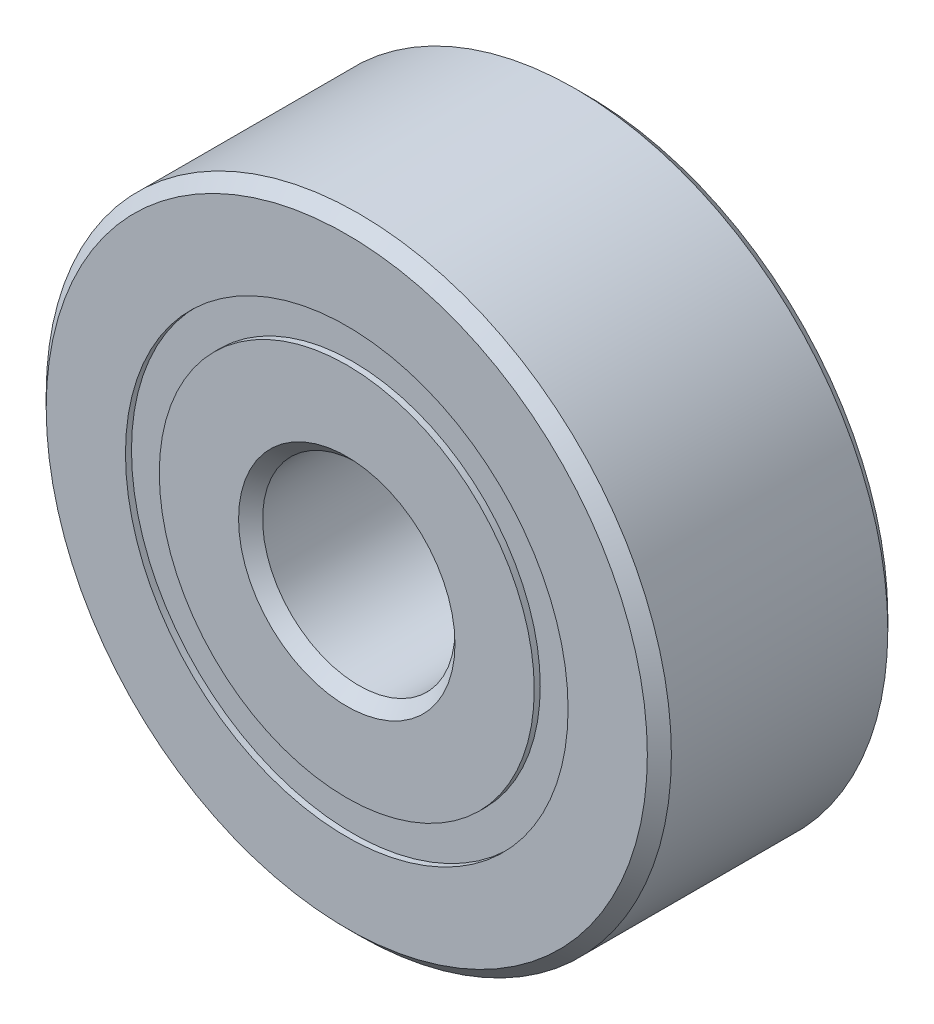
ISO-10303-21;
HEADER;
FILE_DESCRIPTION(('STEP AP214'),'2;1');
FILE_NAME('part.step','',(''),(''),'','','');
FILE_SCHEMA(('AUTOMOTIVE_DESIGN { 1 0 10303 214 1 1 1 1 }'));
ENDSEC;
DATA;
#1=APPLICATION_CONTEXT('core data for automotive mechanical design processes');
#2=APPLICATION_PROTOCOL_DEFINITION('international standard','automotive_design',2000,#1);
#3=PRODUCT_CONTEXT('',#1,'mechanical');
#4=PRODUCT('Part','Part','',(#3));
#5=PRODUCT_RELATED_PRODUCT_CATEGORY('part','',(#4));
#6=PRODUCT_DEFINITION_FORMATION('','',#4);
#7=PRODUCT_DEFINITION_CONTEXT('part definition',#1,'design');
#8=PRODUCT_DEFINITION('design','',#6,#7);
#9=PRODUCT_DEFINITION_SHAPE('','',#8);
#10=(LENGTH_UNIT() NAMED_UNIT(*) SI_UNIT(.MILLI.,.METRE.));
#11=(NAMED_UNIT(*) PLANE_ANGLE_UNIT() SI_UNIT($,.RADIAN.));
#12=(NAMED_UNIT(*) SI_UNIT($,.STERADIAN.) SOLID_ANGLE_UNIT());
#13=UNCERTAINTY_MEASURE_WITH_UNIT(LENGTH_MEASURE(1.E-05),#10,'distance_accuracy_value','');
#14=(GEOMETRIC_REPRESENTATION_CONTEXT(3) GLOBAL_UNCERTAINTY_ASSIGNED_CONTEXT((#13)) GLOBAL_UNIT_ASSIGNED_CONTEXT((#10,
#11,#12)) REPRESENTATION_CONTEXT('',''));
#15=CARTESIAN_POINT('',(0.,0.,0.));
#16=DIRECTION('',(0.,0.,1.));
#17=DIRECTION('',(1.,0.,0.));
#18=AXIS2_PLACEMENT_3D('',#15,#16,#17);
#19=CARTESIAN_POINT('',(0.,4.60164835164835,-2.375));
#20=DIRECTION('',(0.,0.,1.));
#21=DIRECTION('',(1.,0.,0.));
#22=AXIS2_PLACEMENT_3D('',#19,#20,#21);
#23=PLANE('',#22);
#24=CARTESIAN_POINT('',(0.,0.,-2.375));
#25=DIRECTION('',(0.,0.,1.));
#26=DIRECTION('',(1.,0.,0.));
#27=AXIS2_PLACEMENT_3D('',#24,#25,#26);
#28=CIRCLE('',#27,4.60164835164835);
#29=CARTESIAN_POINT('',(4.60164835164835,0.,-2.375));
#30=VERTEX_POINT('',#29);
#31=EDGE_CURVE('E57',#30,#30,#28,.T.);
#32=ORIENTED_EDGE('',*,*,#31,.F.);
#33=EDGE_LOOP('',(#32));
#34=FACE_BOUND('',#33,.T.);
#35=CARTESIAN_POINT('',(0.,0.,-2.375));
#36=DIRECTION('',(0.,0.,1.));
#37=DIRECTION('',(1.,0.,0.));
#38=AXIS2_PLACEMENT_3D('',#35,#36,#37);
#39=CIRCLE('',#38,3.89835164835165);
#40=CARTESIAN_POINT('',(3.89835164835165,0.,-2.375));
#41=VERTEX_POINT('',#40);
#42=EDGE_CURVE('E11',#41,#41,#39,.T.);
#43=ORIENTED_EDGE('',*,*,#42,.T.);
#44=EDGE_LOOP('',(#43));
#45=FACE_BOUND('',#44,.T.);
#46=ADVANCED_FACE('F43',(#34,#45),#23,.F.);
#47=CARTESIAN_POINT('',(0.,0.,2.5));
#48=DIRECTION('',(0.,0.,1.));
#49=DIRECTION('',(1.,0.,0.));
#50=AXIS2_PLACEMENT_3D('',#47,#48,#49);
#51=CYLINDRICAL_SURFACE('',#50,3.89835164835165);
#52=ORIENTED_EDGE('',*,*,#42,.F.);
#53=EDGE_LOOP('',(#52));
#54=FACE_BOUND('',#53,.T.);
#55=CARTESIAN_POINT('',(0.,0.,-1.16542887575844));
#56=DIRECTION('',(0.,0.,1.));
#57=DIRECTION('',(1.,0.,0.));
#58=AXIS2_PLACEMENT_3D('',#55,#56,#57);
#59=CIRCLE('',#58,3.89835164835165);
#60=CARTESIAN_POINT('',(3.89835164835165,0.,-1.16542887575844));
#61=VERTEX_POINT('',#60);
#62=EDGE_CURVE('E49',#61,#61,#59,.T.);
#63=ORIENTED_EDGE('',*,*,#62,.T.);
#64=EDGE_LOOP('',(#63));
#65=FACE_BOUND('',#64,.T.);
#66=ADVANCED_FACE('F66',(#54,#65),#51,.F.);
#67=CARTESIAN_POINT('',(0.,4.60164835164835,-1.16542887575844));
#68=DIRECTION('',(0.,0.,-1.));
#69=DIRECTION('',(-1.,0.,0.));
#70=AXIS2_PLACEMENT_3D('',#67,#68,#69);
#71=PLANE('',#70);
#72=ORIENTED_EDGE('',*,*,#62,.F.);
#73=EDGE_LOOP('',(#72));
#74=FACE_BOUND('',#73,.T.);
#75=CARTESIAN_POINT('',(0.,0.,-1.16542887575844));
#76=DIRECTION('',(0.,0.,1.));
#77=DIRECTION('',(1.,0.,0.));
#78=AXIS2_PLACEMENT_3D('',#75,#76,#77);
#79=CIRCLE('',#78,4.60164835164835);
#80=CARTESIAN_POINT('',(4.60164835164835,0.,-1.16542887575844));
#81=VERTEX_POINT('',#80);
#82=EDGE_CURVE('E53',#81,#81,#79,.T.);
#83=ORIENTED_EDGE('',*,*,#82,.T.);
#84=EDGE_LOOP('',(#83));
#85=FACE_BOUND('',#84,.T.);
#86=ADVANCED_FACE('F70',(#74,#85),#71,.F.);
#87=CARTESIAN_POINT('',(0.,0.,2.5));
#88=DIRECTION('',(0.,0.,1.));
#89=DIRECTION('',(1.,0.,0.));
#90=AXIS2_PLACEMENT_3D('',#87,#88,#89);
#91=CYLINDRICAL_SURFACE('',#90,4.60164835164835);
#92=ORIENTED_EDGE('',*,*,#82,.F.);
#93=EDGE_LOOP('',(#92));
#94=FACE_BOUND('',#93,.T.);
#95=ORIENTED_EDGE('',*,*,#31,.T.);
#96=EDGE_LOOP('',(#95));
#97=FACE_BOUND('',#96,.T.);
#98=ADVANCED_FACE('F63',(#94,#97),#91,.T.);
#99=CLOSED_SHELL('',(#46,#66,#86,#98));
#100=MANIFOLD_SOLID_BREP('B2',#99);
#101=CARTESIAN_POINT('',(0.,4.60164835164835,2.375));
#102=DIRECTION('',(0.,0.,-1.));
#103=DIRECTION('',(-1.,0.,0.));
#104=AXIS2_PLACEMENT_3D('',#101,#102,#103);
#105=PLANE('',#104);
#106=CARTESIAN_POINT('',(0.,0.,2.375));
#107=DIRECTION('',(0.,0.,1.));
#108=DIRECTION('',(1.,0.,0.));
#109=AXIS2_PLACEMENT_3D('',#106,#107,#108);
#110=CIRCLE('',#109,3.89835164835165);
#111=CARTESIAN_POINT('',(3.89835164835165,0.,2.375));
#112=VERTEX_POINT('',#111);
#113=EDGE_CURVE('E42',#112,#112,#110,.T.);
#114=ORIENTED_EDGE('',*,*,#113,.F.);
#115=EDGE_LOOP('',(#114));
#116=FACE_BOUND('',#115,.T.);
#117=CARTESIAN_POINT('',(0.,0.,2.375));
#118=DIRECTION('',(0.,0.,1.));
#119=DIRECTION('',(1.,0.,0.));
#120=AXIS2_PLACEMENT_3D('',#117,#118,#119);
#121=CIRCLE('',#120,4.60164835164835);
#122=CARTESIAN_POINT('',(4.60164835164835,0.,2.375));
#123=VERTEX_POINT('',#122);
#124=EDGE_CURVE('E124',#123,#123,#121,.T.);
#125=ORIENTED_EDGE('',*,*,#124,.T.);
#126=EDGE_LOOP('',(#125));
#127=FACE_BOUND('',#126,.T.);
#128=ADVANCED_FACE('F110',(#116,#127),#105,.F.);
#129=CARTESIAN_POINT('',(0.,0.,2.5));
#130=DIRECTION('',(0.,0.,1.));
#131=DIRECTION('',(1.,0.,0.));
#132=AXIS2_PLACEMENT_3D('',#129,#130,#131);
#133=CYLINDRICAL_SURFACE('',#132,3.89835164835165);
#134=CARTESIAN_POINT('',(0.,0.,1.16542887575844));
#135=DIRECTION('',(0.,0.,1.));
#136=DIRECTION('',(1.,0.,0.));
#137=AXIS2_PLACEMENT_3D('',#134,#135,#136);
#138=CIRCLE('',#137,3.89835164835165);
#139=CARTESIAN_POINT('',(3.89835164835165,0.,1.16542887575844));
#140=VERTEX_POINT('',#139);
#141=EDGE_CURVE('E116',#140,#140,#138,.T.);
#142=ORIENTED_EDGE('',*,*,#141,.F.);
#143=EDGE_LOOP('',(#142));
#144=FACE_BOUND('',#143,.T.);
#145=ORIENTED_EDGE('',*,*,#113,.T.);
#146=EDGE_LOOP('',(#145));
#147=FACE_BOUND('',#146,.T.);
#148=ADVANCED_FACE('F139',(#144,#147),#133,.F.);
#149=CARTESIAN_POINT('',(0.,4.60164835164835,1.16542887575844));
#150=DIRECTION('',(0.,0.,1.));
#151=DIRECTION('',(1.,0.,0.));
#152=AXIS2_PLACEMENT_3D('',#149,#150,#151);
#153=PLANE('',#152);
#154=CARTESIAN_POINT('',(0.,0.,1.16542887575844));
#155=DIRECTION('',(0.,0.,1.));
#156=DIRECTION('',(1.,0.,0.));
#157=AXIS2_PLACEMENT_3D('',#154,#155,#156);
#158=CIRCLE('',#157,4.60164835164835);
#159=CARTESIAN_POINT('',(4.60164835164835,0.,1.16542887575844));
#160=VERTEX_POINT('',#159);
#161=EDGE_CURVE('E120',#160,#160,#158,.T.);
#162=ORIENTED_EDGE('',*,*,#161,.F.);
#163=EDGE_LOOP('',(#162));
#164=FACE_BOUND('',#163,.T.);
#165=ORIENTED_EDGE('',*,*,#141,.T.);
#166=EDGE_LOOP('',(#165));
#167=FACE_BOUND('',#166,.T.);
#168=ADVANCED_FACE('F134',(#164,#167),#153,.F.);
#169=CARTESIAN_POINT('',(0.,0.,2.5));
#170=DIRECTION('',(0.,0.,1.));
#171=DIRECTION('',(1.,0.,0.));
#172=AXIS2_PLACEMENT_3D('',#169,#170,#171);
#173=CYLINDRICAL_SURFACE('',#172,4.60164835164835);
#174=ORIENTED_EDGE('',*,*,#124,.F.);
#175=EDGE_LOOP('',(#174));
#176=FACE_BOUND('',#175,.T.);
#177=ORIENTED_EDGE('',*,*,#161,.T.);
#178=EDGE_LOOP('',(#177));
#179=FACE_BOUND('',#178,.T.);
#180=ADVANCED_FACE('F131',(#176,#179),#173,.T.);
#181=CLOSED_SHELL('',(#128,#148,#168,#180));
#182=MANIFOLD_SOLID_BREP('B6',#181);
#183=CARTESIAN_POINT('',(-2.12499999999995,3.68060796608389,0.));
#184=DIRECTION('',(0.,0.,1.));
#185=DIRECTION('',(-0.499999999999989,0.866025403784445,0.));
#186=AXIS2_PLACEMENT_3D('',#183,#184,#185);
#187=SPHERICAL_SURFACE('',#186,1.16542887575844);
#188=CARTESIAN_POINT('',(-2.12499999999995,3.68060796608389,1.16542887575844));
#189=VERTEX_POINT('',#188);
#190=VERTEX_LOOP('',#189);
#191=FACE_BOUND('',#190,.T.);
#192=ADVANCED_FACE('F177',(#191),#187,.T.);
#193=CLOSED_SHELL('',(#192));
#194=MANIFOLD_SOLID_BREP('B37',#193);
#195=CARTESIAN_POINT('',(-3.68060796608384,2.12500000000004,0.));
#196=DIRECTION('',(0.,0.,1.));
#197=DIRECTION('',(-0.866025403784433,0.50000000000001,0.));
#198=AXIS2_PLACEMENT_3D('',#195,#196,#197);
#199=SPHERICAL_SURFACE('',#198,1.16542887575844);
#200=CARTESIAN_POINT('',(-3.68060796608384,2.12500000000004,1.16542887575844));
#201=VERTEX_POINT('',#200);
#202=VERTEX_LOOP('',#201);
#203=FACE_BOUND('',#202,.T.);
#204=ADVANCED_FACE('F197',(#203),#199,.T.);
#205=CLOSED_SHELL('',(#204));
#206=MANIFOLD_SOLID_BREP('B106',#205);
#207=CARTESIAN_POINT('',(-4.25,0.,0.));
#208=DIRECTION('',(0.,0.,1.));
#209=DIRECTION('',(-1.,0.,0.));
#210=AXIS2_PLACEMENT_3D('',#207,#208,#209);
#211=SPHERICAL_SURFACE('',#210,1.16542887575844);
#212=CARTESIAN_POINT('',(-4.25,0.,1.16542887575844));
#213=VERTEX_POINT('',#212);
#214=VERTEX_LOOP('',#213);
#215=FACE_BOUND('',#214,.T.);
#216=ADVANCED_FACE('F217',(#215),#211,.T.);
#217=CLOSED_SHELL('',(#216));
#218=MANIFOLD_SOLID_BREP('B173',#217);
#219=CARTESIAN_POINT('',(-3.68060796608388,-2.12499999999997,0.));
#220=DIRECTION('',(0.,0.,1.));
#221=DIRECTION('',(-0.866025403784443,-0.499999999999992,0.));
#222=AXIS2_PLACEMENT_3D('',#219,#220,#221);
#223=SPHERICAL_SURFACE('',#222,1.16542887575844);
#224=CARTESIAN_POINT('',(-3.68060796608388,-2.12499999999997,1.16542887575844));
#225=VERTEX_POINT('',#224);
#226=VERTEX_LOOP('',#225);
#227=FACE_BOUND('',#226,.T.);
#228=ADVANCED_FACE('F237',(#227),#223,.T.);
#229=CLOSED_SHELL('',(#228));
#230=MANIFOLD_SOLID_BREP('B193',#229);
#231=CARTESIAN_POINT('',(-2.12500000000003,-3.68060796608385,0.));
#232=DIRECTION('',(0.,0.,1.));
#233=DIRECTION('',(-0.500000000000007,-0.866025403784435,0.));
#234=AXIS2_PLACEMENT_3D('',#231,#232,#233);
#235=SPHERICAL_SURFACE('',#234,1.16542887575844);
#236=CARTESIAN_POINT('',(-2.12500000000003,-3.68060796608385,1.16542887575844));
#237=VERTEX_POINT('',#236);
#238=VERTEX_LOOP('',#237);
#239=FACE_BOUND('',#238,.T.);
#240=ADVANCED_FACE('F257',(#239),#235,.T.);
#241=CLOSED_SHELL('',(#240));
#242=MANIFOLD_SOLID_BREP('B213',#241);
#243=CARTESIAN_POINT('',(0.,-4.25,0.));
#244=DIRECTION('',(0.,0.,1.));
#245=DIRECTION('',(0.,-1.,0.));
#246=AXIS2_PLACEMENT_3D('',#243,#244,#245);
#247=SPHERICAL_SURFACE('',#246,1.16542887575844);
#248=CARTESIAN_POINT('',(0.,-4.25,1.16542887575844));
#249=VERTEX_POINT('',#248);
#250=VERTEX_LOOP('',#249);
#251=FACE_BOUND('',#250,.T.);
#252=ADVANCED_FACE('F277',(#251),#247,.T.);
#253=CLOSED_SHELL('',(#252));
#254=MANIFOLD_SOLID_BREP('B233',#253);
#255=CARTESIAN_POINT('',(2.12499999999998,-3.68060796608388,0.));
#256=DIRECTION('',(0.,0.,1.));
#257=DIRECTION('',(0.499999999999995,-0.866025403784442,0.));
#258=AXIS2_PLACEMENT_3D('',#255,#256,#257);
#259=SPHERICAL_SURFACE('',#258,1.16542887575844);
#260=CARTESIAN_POINT('',(2.12499999999998,-3.68060796608388,1.16542887575844));
#261=VERTEX_POINT('',#260);
#262=VERTEX_LOOP('',#261);
#263=FACE_BOUND('',#262,.T.);
#264=ADVANCED_FACE('F297',(#263),#259,.T.);
#265=CLOSED_SHELL('',(#264));
#266=MANIFOLD_SOLID_BREP('B253',#265);
#267=CARTESIAN_POINT('',(3.68060796608386,-2.12500000000002,0.));
#268=DIRECTION('',(0.,0.,1.));
#269=DIRECTION('',(0.866025403784436,-0.500000000000004,0.));
#270=AXIS2_PLACEMENT_3D('',#267,#268,#269);
#271=SPHERICAL_SURFACE('',#270,1.16542887575844);
#272=CARTESIAN_POINT('',(3.68060796608386,-2.12500000000002,1.16542887575844));
#273=VERTEX_POINT('',#272);
#274=VERTEX_LOOP('',#273);
#275=FACE_BOUND('',#274,.T.);
#276=ADVANCED_FACE('F317',(#275),#271,.T.);
#277=CLOSED_SHELL('',(#276));
#278=MANIFOLD_SOLID_BREP('B273',#277);
#279=CARTESIAN_POINT('',(4.25,0.,0.));
#280=DIRECTION('',(0.,0.,1.));
#281=DIRECTION('',(1.,0.,0.));
#282=AXIS2_PLACEMENT_3D('',#279,#280,#281);
#283=SPHERICAL_SURFACE('',#282,1.16542887575844);
#284=CARTESIAN_POINT('',(4.25,0.,1.16542887575844));
#285=VERTEX_POINT('',#284);
#286=VERTEX_LOOP('',#285);
#287=FACE_BOUND('',#286,.T.);
#288=ADVANCED_FACE('F337',(#287),#283,.T.);
#289=CLOSED_SHELL('',(#288));
#290=MANIFOLD_SOLID_BREP('B293',#289);
#291=CARTESIAN_POINT('',(3.68060796608387,2.12499999999999,0.));
#292=DIRECTION('',(0.,0.,1.));
#293=DIRECTION('',(0.86602540378444,0.499999999999998,0.));
#294=AXIS2_PLACEMENT_3D('',#291,#292,#293);
#295=SPHERICAL_SURFACE('',#294,1.16542887575844);
#296=CARTESIAN_POINT('',(3.68060796608387,2.12499999999999,1.16542887575844));
#297=VERTEX_POINT('',#296);
#298=VERTEX_LOOP('',#297);
#299=FACE_BOUND('',#298,.T.);
#300=ADVANCED_FACE('F357',(#299),#295,.T.);
#301=CLOSED_SHELL('',(#300));
#302=MANIFOLD_SOLID_BREP('B313',#301);
#303=CARTESIAN_POINT('',(2.125,3.68060796608386,0.));
#304=DIRECTION('',(0.,0.,1.));
#305=DIRECTION('',(0.500000000000001,0.866025403784438,0.));
#306=AXIS2_PLACEMENT_3D('',#303,#304,#305);
#307=SPHERICAL_SURFACE('',#306,1.16542887575844);
#308=CARTESIAN_POINT('',(2.125,3.68060796608386,1.16542887575844));
#309=VERTEX_POINT('',#308);
#310=VERTEX_LOOP('',#309);
#311=FACE_BOUND('',#310,.T.);
#312=ADVANCED_FACE('F377',(#311),#307,.T.);
#313=CLOSED_SHELL('',(#312));
#314=MANIFOLD_SOLID_BREP('B333',#313);
#315=CARTESIAN_POINT('',(0.,4.25,0.));
#316=DIRECTION('',(0.,0.,1.));
#317=DIRECTION('',(0.,1.,0.));
#318=AXIS2_PLACEMENT_3D('',#315,#316,#317);
#319=SPHERICAL_SURFACE('',#318,1.16542887575844);
#320=CARTESIAN_POINT('',(0.,4.25,1.16542887575844));
#321=VERTEX_POINT('',#320);
#322=VERTEX_LOOP('',#321);
#323=FACE_BOUND('',#322,.T.);
#324=ADVANCED_FACE('F399',(#323),#319,.T.);
#325=CLOSED_SHELL('',(#324));
#326=MANIFOLD_SOLID_BREP('B353',#325);
#327=CARTESIAN_POINT('',(0.,3.89835164835165,2.5));
#328=DIRECTION('',(0.,0.,-1.));
#329=DIRECTION('',(-1.,0.,0.));
#330=AXIS2_PLACEMENT_3D('',#327,#328,#329);
#331=PLANE('',#330);
#332=CARTESIAN_POINT('',(0.,0.,2.5));
#333=DIRECTION('',(0.,0.,1.));
#334=DIRECTION('',(1.,0.,0.));
#335=AXIS2_PLACEMENT_3D('',#332,#333,#334);
#336=CIRCLE('',#335,2.25);
#337=CARTESIAN_POINT('',(2.25,0.,2.5));
#338=VERTEX_POINT('',#337);
#339=EDGE_CURVE('E446',#338,#338,#336,.T.);
#340=ORIENTED_EDGE('',*,*,#339,.F.);
#341=EDGE_LOOP('',(#340));
#342=FACE_BOUND('',#341,.T.);
#343=CARTESIAN_POINT('',(0.,0.,2.5));
#344=DIRECTION('',(0.,0.,1.));
#345=DIRECTION('',(1.,0.,0.));
#346=AXIS2_PLACEMENT_3D('',#343,#344,#345);
#347=CIRCLE('',#346,3.89835164835165);
#348=CARTESIAN_POINT('',(3.89835164835165,0.,2.5));
#349=VERTEX_POINT('',#348);
#350=EDGE_CURVE('E398',#349,#349,#347,.T.);
#351=ORIENTED_EDGE('',*,*,#350,.T.);
#352=EDGE_LOOP('',(#351));
#353=FACE_BOUND('',#352,.T.);
#354=ADVANCED_FACE('F418',(#342,#353),#331,.F.);
#355=CARTESIAN_POINT('',(0.,0.,2.5));
#356=DIRECTION('',(0.,0.,1.));
#357=DIRECTION('',(1.,0.,0.));
#358=AXIS2_PLACEMENT_3D('',#355,#356,#357);
#359=CYLINDRICAL_SURFACE('',#358,3.89835164835165);
#360=ORIENTED_EDGE('',*,*,#350,.F.);
#361=EDGE_LOOP('',(#360));
#362=FACE_BOUND('',#361,.T.);
#363=CARTESIAN_POINT('',(0.,0.,1.11111111111111));
#364=DIRECTION('',(0.,0.,1.));
#365=DIRECTION('',(1.,0.,0.));
#366=AXIS2_PLACEMENT_3D('',#363,#364,#365);
#367=CIRCLE('',#366,3.89835164835165);
#368=CARTESIAN_POINT('',(3.89835164835165,0.,1.11111111111111));
#369=VERTEX_POINT('',#368);
#370=EDGE_CURVE('E424',#369,#369,#367,.T.);
#371=ORIENTED_EDGE('',*,*,#370,.T.);
#372=EDGE_LOOP('',(#371));
#373=FACE_BOUND('',#372,.T.);
#374=ADVANCED_FACE('F453',(#362,#373),#359,.T.);
#375=CARTESIAN_POINT('',(0.,0.,0.));
#376=DIRECTION('',(0.,0.,1.));
#377=DIRECTION('',(1.,0.,0.));
#378=AXIS2_PLACEMENT_3D('',#375,#376,#377);
#379=TOROIDAL_SURFACE('',#378,4.25,1.16542887575843);
#380=ORIENTED_EDGE('',*,*,#370,.F.);
#381=EDGE_LOOP('',(#380));
#382=FACE_BOUND('',#381,.T.);
#383=CARTESIAN_POINT('',(0.,0.,-1.11111111111111));
#384=DIRECTION('',(0.,0.,1.));
#385=DIRECTION('',(1.,0.,0.));
#386=AXIS2_PLACEMENT_3D('',#383,#384,#385);
#387=CIRCLE('',#386,3.89835164835165);
#388=CARTESIAN_POINT('',(3.89835164835165,0.,-1.11111111111111));
#389=VERTEX_POINT('',#388);
#390=EDGE_CURVE('E428',#389,#389,#387,.T.);
#391=ORIENTED_EDGE('',*,*,#390,.T.);
#392=EDGE_LOOP('',(#391));
#393=FACE_BOUND('',#392,.T.);
#394=ADVANCED_FACE('F457',(#382,#393),#379,.F.);
#395=CARTESIAN_POINT('',(0.,0.,2.5));
#396=DIRECTION('',(0.,0.,1.));
#397=DIRECTION('',(1.,0.,0.));
#398=AXIS2_PLACEMENT_3D('',#395,#396,#397);
#399=CYLINDRICAL_SURFACE('',#398,3.89835164835165);
#400=ORIENTED_EDGE('',*,*,#390,.F.);
#401=EDGE_LOOP('',(#400));
#402=FACE_BOUND('',#401,.T.);
#403=CARTESIAN_POINT('',(0.,0.,-2.5));
#404=DIRECTION('',(0.,0.,1.));
#405=DIRECTION('',(1.,0.,0.));
#406=AXIS2_PLACEMENT_3D('',#403,#404,#405);
#407=CIRCLE('',#406,3.89835164835165);
#408=CARTESIAN_POINT('',(3.89835164835165,0.,-2.5));
#409=VERTEX_POINT('',#408);
#410=EDGE_CURVE('E432',#409,#409,#407,.T.);
#411=ORIENTED_EDGE('',*,*,#410,.T.);
#412=EDGE_LOOP('',(#411));
#413=FACE_BOUND('',#412,.T.);
#414=ADVANCED_FACE('F462',(#402,#413),#399,.T.);
#415=CARTESIAN_POINT('',(0.,2.25,-2.5));
#416=DIRECTION('',(0.,0.,1.));
#417=DIRECTION('',(1.,0.,0.));
#418=AXIS2_PLACEMENT_3D('',#415,#416,#417);
#419=PLANE('',#418);
#420=ORIENTED_EDGE('',*,*,#410,.F.);
#421=EDGE_LOOP('',(#420));
#422=FACE_BOUND('',#421,.T.);
#423=CARTESIAN_POINT('',(0.,0.,-2.5));
#424=DIRECTION('',(0.,0.,1.));
#425=DIRECTION('',(1.,0.,0.));
#426=AXIS2_PLACEMENT_3D('',#423,#424,#425);
#427=CIRCLE('',#426,2.25);
#428=CARTESIAN_POINT('',(2.25,0.,-2.5));
#429=VERTEX_POINT('',#428);
#430=EDGE_CURVE('E437',#429,#429,#427,.T.);
#431=ORIENTED_EDGE('',*,*,#430,.T.);
#432=EDGE_LOOP('',(#431));
#433=FACE_BOUND('',#432,.T.);
#434=ADVANCED_FACE('F468',(#422,#433),#419,.F.);
#435=CARTESIAN_POINT('',(0.,0.,-2.25));
#436=DIRECTION('',(0.,0.,-1.));
#437=DIRECTION('',(-1.,0.,0.));
#438=AXIS2_PLACEMENT_3D('',#435,#436,#437);
#439=CONICAL_SURFACE('',#438,2.,0.785398163397445);
#440=ORIENTED_EDGE('',*,*,#430,.F.);
#441=EDGE_LOOP('',(#440));
#442=FACE_BOUND('',#441,.T.);
#443=CARTESIAN_POINT('',(0.,0.,-2.25));
#444=DIRECTION('',(0.,0.,1.));
#445=DIRECTION('',(1.,0.,0.));
#446=AXIS2_PLACEMENT_3D('',#443,#444,#445);
#447=CIRCLE('',#446,2.);
#448=CARTESIAN_POINT('',(2.,0.,-2.25));
#449=VERTEX_POINT('',#448);
#450=EDGE_CURVE('E440',#449,#449,#447,.T.);
#451=ORIENTED_EDGE('',*,*,#450,.T.);
#452=EDGE_LOOP('',(#451));
#453=FACE_BOUND('',#452,.T.);
#454=ADVANCED_FACE('F472',(#442,#453),#439,.F.);
#455=CARTESIAN_POINT('',(0.,0.,2.5));
#456=DIRECTION('',(0.,0.,1.));
#457=DIRECTION('',(1.,0.,0.));
#458=AXIS2_PLACEMENT_3D('',#455,#456,#457);
#459=CYLINDRICAL_SURFACE('',#458,2.);
#460=ORIENTED_EDGE('',*,*,#450,.F.);
#461=EDGE_LOOP('',(#460));
#462=FACE_BOUND('',#461,.T.);
#463=CARTESIAN_POINT('',(0.,0.,2.25));
#464=DIRECTION('',(0.,0.,1.));
#465=DIRECTION('',(1.,0.,0.));
#466=AXIS2_PLACEMENT_3D('',#463,#464,#465);
#467=CIRCLE('',#466,2.);
#468=CARTESIAN_POINT('',(2.,0.,2.25));
#469=VERTEX_POINT('',#468);
#470=EDGE_CURVE('E443',#469,#469,#467,.T.);
#471=ORIENTED_EDGE('',*,*,#470,.T.);
#472=EDGE_LOOP('',(#471));
#473=FACE_BOUND('',#472,.T.);
#474=ADVANCED_FACE('F476',(#462,#473),#459,.F.);
#475=CARTESIAN_POINT('',(0.,0.,2.5));
#476=DIRECTION('',(0.,0.,1.));
#477=DIRECTION('',(1.,0.,0.));
#478=AXIS2_PLACEMENT_3D('',#475,#476,#477);
#479=CONICAL_SURFACE('',#478,2.25,0.785398163397452);
#480=ORIENTED_EDGE('',*,*,#470,.F.);
#481=EDGE_LOOP('',(#480));
#482=FACE_BOUND('',#481,.T.);
#483=ORIENTED_EDGE('',*,*,#339,.T.);
#484=EDGE_LOOP('',(#483));
#485=FACE_BOUND('',#484,.T.);
#486=ADVANCED_FACE('F450',(#482,#485),#479,.F.);
#487=CLOSED_SHELL('',(#354,#374,#394,#414,#434,#454,#474,#486));
#488=MANIFOLD_SOLID_BREP('B373',#487);
#489=CARTESIAN_POINT('',(0.,0.,2.25));
#490=DIRECTION('',(0.,0.,-1.));
#491=DIRECTION('',(-1.,0.,0.));
#492=AXIS2_PLACEMENT_3D('',#489,#490,#491);
#493=CONICAL_SURFACE('',#492,6.5,0.785398163397445);
#494=CARTESIAN_POINT('',(0.,0.,2.5));
#495=DIRECTION('',(0.,0.,1.));
#496=DIRECTION('',(1.,0.,0.));
#497=AXIS2_PLACEMENT_3D('',#494,#495,#496);
#498=CIRCLE('',#497,6.25);
#499=CARTESIAN_POINT('',(6.25,0.,2.5));
#500=VERTEX_POINT('',#499);
#501=EDGE_CURVE('E567',#500,#500,#498,.T.);
#502=ORIENTED_EDGE('',*,*,#501,.F.);
#503=EDGE_LOOP('',(#502));
#504=FACE_BOUND('',#503,.T.);
#505=CARTESIAN_POINT('',(0.,0.,2.25));
#506=DIRECTION('',(0.,0.,1.));
#507=DIRECTION('',(1.,0.,0.));
#508=AXIS2_PLACEMENT_3D('',#505,#506,#507);
#509=CIRCLE('',#508,6.5);
#510=CARTESIAN_POINT('',(6.5,0.,2.25));
#511=VERTEX_POINT('',#510);
#512=EDGE_CURVE('E417',#511,#511,#509,.T.);
#513=ORIENTED_EDGE('',*,*,#512,.T.);
#514=EDGE_LOOP('',(#513));
#515=FACE_BOUND('',#514,.T.);
#516=ADVANCED_FACE('F539',(#504,#515),#493,.T.);
#517=CARTESIAN_POINT('',(0.,0.,2.5));
#518=DIRECTION('',(0.,0.,1.));
#519=DIRECTION('',(1.,0.,0.));
#520=AXIS2_PLACEMENT_3D('',#517,#518,#519);
#521=CYLINDRICAL_SURFACE('',#520,6.5);
#522=ORIENTED_EDGE('',*,*,#512,.F.);
#523=EDGE_LOOP('',(#522));
#524=FACE_BOUND('',#523,.T.);
#525=CARTESIAN_POINT('',(0.,0.,-2.25));
#526=DIRECTION('',(0.,0.,1.));
#527=DIRECTION('',(1.,0.,0.));
#528=AXIS2_PLACEMENT_3D('',#525,#526,#527);
#529=CIRCLE('',#528,6.5);
#530=CARTESIAN_POINT('',(6.5,0.,-2.25));
#531=VERTEX_POINT('',#530);
#532=EDGE_CURVE('E545',#531,#531,#529,.T.);
#533=ORIENTED_EDGE('',*,*,#532,.T.);
#534=EDGE_LOOP('',(#533));
#535=FACE_BOUND('',#534,.T.);
#536=ADVANCED_FACE('F574',(#524,#535),#521,.T.);
#537=CARTESIAN_POINT('',(0.,0.,-2.5));
#538=DIRECTION('',(0.,0.,1.));
#539=DIRECTION('',(1.,0.,0.));
#540=AXIS2_PLACEMENT_3D('',#537,#538,#539);
#541=CONICAL_SURFACE('',#540,6.25,0.785398163397445);
#542=ORIENTED_EDGE('',*,*,#532,.F.);
#543=EDGE_LOOP('',(#542));
#544=FACE_BOUND('',#543,.T.);
#545=CARTESIAN_POINT('',(0.,0.,-2.5));
#546=DIRECTION('',(0.,0.,1.));
#547=DIRECTION('',(1.,0.,0.));
#548=AXIS2_PLACEMENT_3D('',#545,#546,#547);
#549=CIRCLE('',#548,6.25);
#550=CARTESIAN_POINT('',(6.25,0.,-2.5));
#551=VERTEX_POINT('',#550);
#552=EDGE_CURVE('E549',#551,#551,#549,.T.);
#553=ORIENTED_EDGE('',*,*,#552,.T.);
#554=EDGE_LOOP('',(#553));
#555=FACE_BOUND('',#554,.T.);
#556=ADVANCED_FACE('F578',(#544,#555),#541,.T.);
#557=CARTESIAN_POINT('',(0.,6.25,-2.5));
#558=DIRECTION('',(0.,0.,1.));
#559=DIRECTION('',(1.,0.,0.));
#560=AXIS2_PLACEMENT_3D('',#557,#558,#559);
#561=PLANE('',#560);
#562=ORIENTED_EDGE('',*,*,#552,.F.);
#563=EDGE_LOOP('',(#562));
#564=FACE_BOUND('',#563,.T.);
#565=CARTESIAN_POINT('',(0.,0.,-2.5));
#566=DIRECTION('',(0.,0.,1.));
#567=DIRECTION('',(1.,0.,0.));
#568=AXIS2_PLACEMENT_3D('',#565,#566,#567);
#569=CIRCLE('',#568,4.60164835164835);
#570=CARTESIAN_POINT('',(4.60164835164835,0.,-2.5));
#571=VERTEX_POINT('',#570);
#572=EDGE_CURVE('E553',#571,#571,#569,.T.);
#573=ORIENTED_EDGE('',*,*,#572,.T.);
#574=EDGE_LOOP('',(#573));
#575=FACE_BOUND('',#574,.T.);
#576=ADVANCED_FACE('F583',(#564,#575),#561,.F.);
#577=CARTESIAN_POINT('',(0.,0.,2.5));
#578=DIRECTION('',(0.,0.,1.));
#579=DIRECTION('',(1.,0.,0.));
#580=AXIS2_PLACEMENT_3D('',#577,#578,#579);
#581=CYLINDRICAL_SURFACE('',#580,4.60164835164835);
#582=ORIENTED_EDGE('',*,*,#572,.F.);
#583=EDGE_LOOP('',(#582));
#584=FACE_BOUND('',#583,.T.);
#585=CARTESIAN_POINT('',(0.,0.,-1.11111111111111));
#586=DIRECTION('',(0.,0.,1.));
#587=DIRECTION('',(1.,0.,0.));
#588=AXIS2_PLACEMENT_3D('',#585,#586,#587);
#589=CIRCLE('',#588,4.60164835164835);
#590=CARTESIAN_POINT('',(4.60164835164835,0.,-1.11111111111111));
#591=VERTEX_POINT('',#590);
#592=EDGE_CURVE('E558',#591,#591,#589,.T.);
#593=ORIENTED_EDGE('',*,*,#592,.T.);
#594=EDGE_LOOP('',(#593));
#595=FACE_BOUND('',#594,.T.);
#596=ADVANCED_FACE('F589',(#584,#595),#581,.F.);
#597=CARTESIAN_POINT('',(0.,0.,0.));
#598=DIRECTION('',(0.,0.,1.));
#599=DIRECTION('',(1.,0.,0.));
#600=AXIS2_PLACEMENT_3D('',#597,#598,#599);
#601=TOROIDAL_SURFACE('',#600,4.25,1.16542887575844);
#602=ORIENTED_EDGE('',*,*,#592,.F.);
#603=EDGE_LOOP('',(#602));
#604=FACE_BOUND('',#603,.T.);
#605=CARTESIAN_POINT('',(0.,0.,1.11111111111111));
#606=DIRECTION('',(0.,0.,1.));
#607=DIRECTION('',(1.,0.,0.));
#608=AXIS2_PLACEMENT_3D('',#605,#606,#607);
#609=CIRCLE('',#608,4.60164835164835);
#610=CARTESIAN_POINT('',(4.60164835164835,0.,1.11111111111111));
#611=VERTEX_POINT('',#610);
#612=EDGE_CURVE('E561',#611,#611,#609,.T.);
#613=ORIENTED_EDGE('',*,*,#612,.T.);
#614=EDGE_LOOP('',(#613));
#615=FACE_BOUND('',#614,.T.);
#616=ADVANCED_FACE('F593',(#604,#615),#601,.F.);
#617=CARTESIAN_POINT('',(0.,0.,2.5));
#618=DIRECTION('',(0.,0.,1.));
#619=DIRECTION('',(1.,0.,0.));
#620=AXIS2_PLACEMENT_3D('',#617,#618,#619);
#621=CYLINDRICAL_SURFACE('',#620,4.60164835164835);
#622=ORIENTED_EDGE('',*,*,#612,.F.);
#623=EDGE_LOOP('',(#622));
#624=FACE_BOUND('',#623,.T.);
#625=CARTESIAN_POINT('',(0.,0.,2.5));
#626=DIRECTION('',(0.,0.,1.));
#627=DIRECTION('',(1.,0.,0.));
#628=AXIS2_PLACEMENT_3D('',#625,#626,#627);
#629=CIRCLE('',#628,4.60164835164835);
#630=CARTESIAN_POINT('',(4.60164835164835,0.,2.5));
#631=VERTEX_POINT('',#630);
#632=EDGE_CURVE('E564',#631,#631,#629,.T.);
#633=ORIENTED_EDGE('',*,*,#632,.T.);
#634=EDGE_LOOP('',(#633));
#635=FACE_BOUND('',#634,.T.);
#636=ADVANCED_FACE('F597',(#624,#635),#621,.F.);
#637=CARTESIAN_POINT('',(0.,6.25,2.5));
#638=DIRECTION('',(0.,0.,-1.));
#639=DIRECTION('',(-1.,0.,0.));
#640=AXIS2_PLACEMENT_3D('',#637,#638,#639);
#641=PLANE('',#640);
#642=ORIENTED_EDGE('',*,*,#632,.F.);
#643=EDGE_LOOP('',(#642));
#644=FACE_BOUND('',#643,.T.);
#645=ORIENTED_EDGE('',*,*,#501,.T.);
#646=EDGE_LOOP('',(#645));
#647=FACE_BOUND('',#646,.T.);
#648=ADVANCED_FACE('F571',(#644,#647),#641,.F.);
#649=CLOSED_SHELL('',(#516,#536,#556,#576,#596,#616,#636,#648));
#650=MANIFOLD_SOLID_BREP('B393',#649);
#651=ADVANCED_BREP_SHAPE_REPRESENTATION('',(#18,#100,#182,#194,#206,#218,#230,#242,#254,#266,
#278,#290,#302,#314,#326,#488,#650),#14);
#652=SHAPE_DEFINITION_REPRESENTATION(#9,#651);
ENDSEC;
END-ISO-10303-21;
